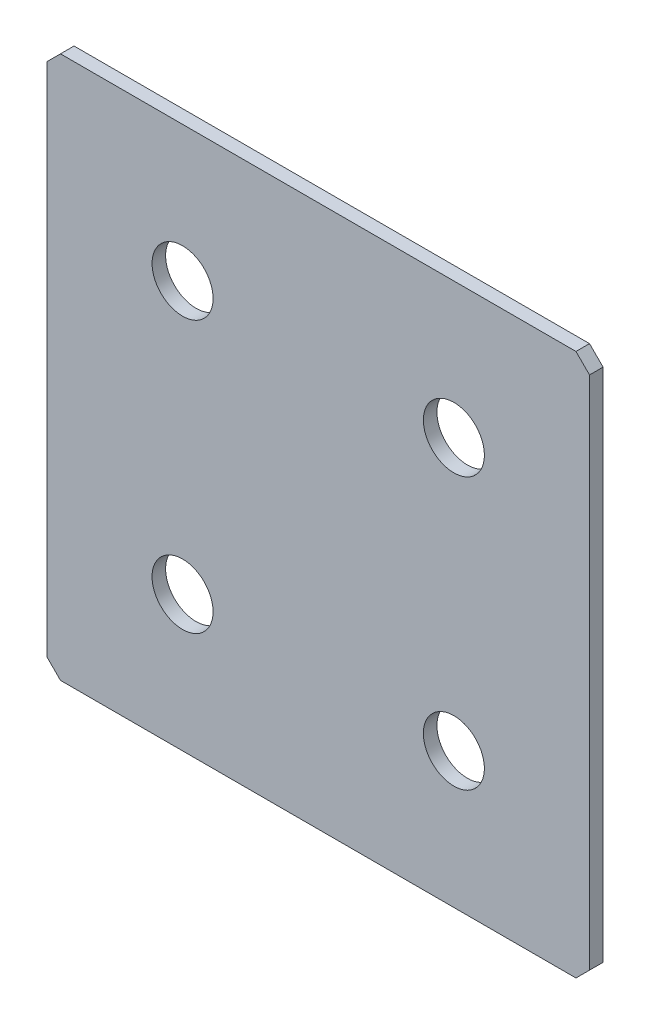
ISO-10303-21;
HEADER;
FILE_DESCRIPTION(('STEP AP214'),'2;1');
FILE_NAME('part.step','',(''),(''),'','','');
FILE_SCHEMA(('AUTOMOTIVE_DESIGN { 1 0 10303 214 1 1 1 1 }'));
ENDSEC;
DATA;
#1=APPLICATION_CONTEXT('core data for automotive mechanical design processes');
#2=APPLICATION_PROTOCOL_DEFINITION('international standard','automotive_design',2000,#1);
#3=PRODUCT_CONTEXT('',#1,'mechanical');
#4=PRODUCT('Part','Part','',(#3));
#5=PRODUCT_RELATED_PRODUCT_CATEGORY('part','',(#4));
#6=PRODUCT_DEFINITION_FORMATION('','',#4);
#7=PRODUCT_DEFINITION_CONTEXT('part definition',#1,'design');
#8=PRODUCT_DEFINITION('design','',#6,#7);
#9=PRODUCT_DEFINITION_SHAPE('','',#8);
#10=(LENGTH_UNIT() NAMED_UNIT(*) SI_UNIT(.MILLI.,.METRE.));
#11=(NAMED_UNIT(*) PLANE_ANGLE_UNIT() SI_UNIT($,.RADIAN.));
#12=(NAMED_UNIT(*) SI_UNIT($,.STERADIAN.) SOLID_ANGLE_UNIT());
#13=UNCERTAINTY_MEASURE_WITH_UNIT(LENGTH_MEASURE(1.E-05),#10,'distance_accuracy_value','');
#14=(GEOMETRIC_REPRESENTATION_CONTEXT(3) GLOBAL_UNCERTAINTY_ASSIGNED_CONTEXT((#13)) GLOBAL_UNIT_ASSIGNED_CONTEXT((#10,
#11,#12)) REPRESENTATION_CONTEXT('',''));
#15=CARTESIAN_POINT('',(0.,0.,0.));
#16=DIRECTION('',(0.,0.,1.));
#17=DIRECTION('',(1.,0.,0.));
#18=AXIS2_PLACEMENT_3D('',#15,#16,#17);
#19=CARTESIAN_POINT('',(40.,-40.,2.));
#20=DIRECTION('',(-1.,0.,0.));
#21=DIRECTION('',(0.,0.,1.));
#22=AXIS2_PLACEMENT_3D('',#19,#20,#21);
#23=PLANE('',#22);
#24=DIRECTION('',(0.,1.,0.));
#25=VECTOR('',#24,1.);
#26=CARTESIAN_POINT('',(40.,-40.,2.));
#27=LINE('',#26,#25);
#28=CARTESIAN_POINT('',(40.,-38.,2.));
#29=VERTEX_POINT('',#28);
#30=CARTESIAN_POINT('',(40.,38.,2.));
#31=VERTEX_POINT('',#30);
#32=EDGE_CURVE('E128',#29,#31,#27,.T.);
#33=ORIENTED_EDGE('',*,*,#32,.F.);
#34=DIRECTION('',(0.,0.,-1.));
#35=VECTOR('',#34,1.);
#36=CARTESIAN_POINT('',(40.,-38.,2.));
#37=LINE('',#36,#35);
#38=CARTESIAN_POINT('',(40.,-38.,0.));
#39=VERTEX_POINT('',#38);
#40=EDGE_CURVE('E154',#29,#39,#37,.T.);
#41=ORIENTED_EDGE('',*,*,#40,.T.);
#42=DIRECTION('',(0.,1.,0.));
#43=VECTOR('',#42,1.);
#44=CARTESIAN_POINT('',(40.,-40.,0.));
#45=LINE('',#44,#43);
#46=CARTESIAN_POINT('',(40.,38.,0.));
#47=VERTEX_POINT('',#46);
#48=EDGE_CURVE('E162',#39,#47,#45,.T.);
#49=ORIENTED_EDGE('',*,*,#48,.T.);
#50=DIRECTION('',(0.,0.,1.));
#51=VECTOR('',#50,1.);
#52=CARTESIAN_POINT('',(40.,38.,2.));
#53=LINE('',#52,#51);
#54=EDGE_CURVE('E152',#47,#31,#53,.T.);
#55=ORIENTED_EDGE('',*,*,#54,.T.);
#56=EDGE_LOOP('',(#33,#41,#49,#55));
#57=FACE_BOUND('',#56,.T.);
#58=ADVANCED_FACE('F37',(#57),#23,.F.);
#59=CARTESIAN_POINT('',(-40.,40.,2.));
#60=DIRECTION('',(0.,-1.,0.));
#61=DIRECTION('',(0.,0.,-1.));
#62=AXIS2_PLACEMENT_3D('',#59,#60,#61);
#63=PLANE('',#62);
#64=DIRECTION('',(-1.,0.,0.));
#65=VECTOR('',#64,1.);
#66=CARTESIAN_POINT('',(-40.,40.,0.));
#67=LINE('',#66,#65);
#68=CARTESIAN_POINT('',(38.,40.,0.));
#69=VERTEX_POINT('',#68);
#70=CARTESIAN_POINT('',(-38.,40.,0.));
#71=VERTEX_POINT('',#70);
#72=EDGE_CURVE('E133',#69,#71,#67,.T.);
#73=ORIENTED_EDGE('',*,*,#72,.T.);
#74=DIRECTION('',(0.,0.,1.));
#75=VECTOR('',#74,1.);
#76=CARTESIAN_POINT('',(-38.,40.,2.));
#77=LINE('',#76,#75);
#78=CARTESIAN_POINT('',(-38.,40.,2.));
#79=VERTEX_POINT('',#78);
#80=EDGE_CURVE('E11',#71,#79,#77,.T.);
#81=ORIENTED_EDGE('',*,*,#80,.T.);
#82=DIRECTION('',(-1.,0.,0.));
#83=VECTOR('',#82,1.);
#84=CARTESIAN_POINT('',(-40.,40.,2.));
#85=LINE('',#84,#83);
#86=CARTESIAN_POINT('',(38.,40.,2.));
#87=VERTEX_POINT('',#86);
#88=EDGE_CURVE('E131',#87,#79,#85,.T.);
#89=ORIENTED_EDGE('',*,*,#88,.F.);
#90=DIRECTION('',(0.,0.,-1.));
#91=VECTOR('',#90,1.);
#92=CARTESIAN_POINT('',(38.,40.,2.));
#93=LINE('',#92,#91);
#94=EDGE_CURVE('E45',#87,#69,#93,.T.);
#95=ORIENTED_EDGE('',*,*,#94,.T.);
#96=EDGE_LOOP('',(#73,#81,#89,#95));
#97=FACE_BOUND('',#96,.T.);
#98=ADVANCED_FACE('F159',(#97),#63,.F.);
#99=CARTESIAN_POINT('',(-40.,-40.,2.));
#100=DIRECTION('',(1.,0.,0.));
#101=DIRECTION('',(0.,0.,-1.));
#102=AXIS2_PLACEMENT_3D('',#99,#100,#101);
#103=PLANE('',#102);
#104=DIRECTION('',(0.,-1.,0.));
#105=VECTOR('',#104,1.);
#106=CARTESIAN_POINT('',(-40.,-40.,0.));
#107=LINE('',#106,#105);
#108=CARTESIAN_POINT('',(-40.,38.,0.));
#109=VERTEX_POINT('',#108);
#110=CARTESIAN_POINT('',(-40.,-38.,0.));
#111=VERTEX_POINT('',#110);
#112=EDGE_CURVE('E129',#109,#111,#107,.T.);
#113=ORIENTED_EDGE('',*,*,#112,.T.);
#114=DIRECTION('',(0.,0.,1.));
#115=VECTOR('',#114,1.);
#116=CARTESIAN_POINT('',(-40.,-38.,2.));
#117=LINE('',#116,#115);
#118=CARTESIAN_POINT('',(-40.,-38.,2.));
#119=VERTEX_POINT('',#118);
#120=EDGE_CURVE('E107',#111,#119,#117,.T.);
#121=ORIENTED_EDGE('',*,*,#120,.T.);
#122=DIRECTION('',(0.,-1.,0.));
#123=VECTOR('',#122,1.);
#124=CARTESIAN_POINT('',(-40.,-40.,2.));
#125=LINE('',#124,#123);
#126=CARTESIAN_POINT('',(-40.,38.,2.));
#127=VERTEX_POINT('',#126);
#128=EDGE_CURVE('E167',#127,#119,#125,.T.);
#129=ORIENTED_EDGE('',*,*,#128,.F.);
#130=DIRECTION('',(0.,0.,-1.));
#131=VECTOR('',#130,1.);
#132=CARTESIAN_POINT('',(-40.,38.,2.));
#133=LINE('',#132,#131);
#134=EDGE_CURVE('E112',#127,#109,#133,.T.);
#135=ORIENTED_EDGE('',*,*,#134,.T.);
#136=EDGE_LOOP('',(#113,#121,#129,#135));
#137=FACE_BOUND('',#136,.T.);
#138=ADVANCED_FACE('F210',(#137),#103,.F.);
#139=CARTESIAN_POINT('',(-40.,-40.,2.));
#140=DIRECTION('',(0.,1.,0.));
#141=DIRECTION('',(0.,0.,1.));
#142=AXIS2_PLACEMENT_3D('',#139,#140,#141);
#143=PLANE('',#142);
#144=DIRECTION('',(1.,0.,0.));
#145=VECTOR('',#144,1.);
#146=CARTESIAN_POINT('',(-40.,-40.,2.));
#147=LINE('',#146,#145);
#148=CARTESIAN_POINT('',(-38.,-40.,2.));
#149=VERTEX_POINT('',#148);
#150=CARTESIAN_POINT('',(38.,-40.,2.));
#151=VERTEX_POINT('',#150);
#152=EDGE_CURVE('E122',#149,#151,#147,.T.);
#153=ORIENTED_EDGE('',*,*,#152,.F.);
#154=DIRECTION('',(0.,0.,-1.));
#155=VECTOR('',#154,1.);
#156=CARTESIAN_POINT('',(-38.,-40.,2.));
#157=LINE('',#156,#155);
#158=CARTESIAN_POINT('',(-38.,-40.,0.));
#159=VERTEX_POINT('',#158);
#160=EDGE_CURVE('E106',#149,#159,#157,.T.);
#161=ORIENTED_EDGE('',*,*,#160,.T.);
#162=DIRECTION('',(1.,0.,0.));
#163=VECTOR('',#162,1.);
#164=CARTESIAN_POINT('',(-40.,-40.,0.));
#165=LINE('',#164,#163);
#166=CARTESIAN_POINT('',(38.,-40.,0.));
#167=VERTEX_POINT('',#166);
#168=EDGE_CURVE('E119',#159,#167,#165,.T.);
#169=ORIENTED_EDGE('',*,*,#168,.T.);
#170=DIRECTION('',(0.,0.,1.));
#171=VECTOR('',#170,1.);
#172=CARTESIAN_POINT('',(38.,-40.,2.));
#173=LINE('',#172,#171);
#174=EDGE_CURVE('E124',#167,#151,#173,.T.);
#175=ORIENTED_EDGE('',*,*,#174,.T.);
#176=EDGE_LOOP('',(#153,#161,#169,#175));
#177=FACE_BOUND('',#176,.T.);
#178=ADVANCED_FACE('F118',(#177),#143,.F.);
#179=CARTESIAN_POINT('',(0.,0.,2.));
#180=DIRECTION('',(0.,0.,-1.));
#181=DIRECTION('',(-1.,0.,0.));
#182=AXIS2_PLACEMENT_3D('',#179,#180,#181);
#183=PLANE('',#182);
#184=CARTESIAN_POINT('',(-20.,20.,2.));
#185=DIRECTION('',(0.,0.,1.));
#186=DIRECTION('',(1.,0.,0.));
#187=AXIS2_PLACEMENT_3D('',#184,#185,#186);
#188=CIRCLE('',#187,4.5);
#189=CARTESIAN_POINT('',(-15.5,20.,2.));
#190=VERTEX_POINT('',#189);
#191=EDGE_CURVE('E191',#190,#190,#188,.T.);
#192=ORIENTED_EDGE('',*,*,#191,.F.);
#193=EDGE_LOOP('',(#192));
#194=FACE_BOUND('',#193,.T.);
#195=CARTESIAN_POINT('',(20.,20.,2.));
#196=DIRECTION('',(0.,0.,1.));
#197=DIRECTION('',(1.,0.,0.));
#198=AXIS2_PLACEMENT_3D('',#195,#196,#197);
#199=CIRCLE('',#198,4.5);
#200=CARTESIAN_POINT('',(24.5,20.,2.));
#201=VERTEX_POINT('',#200);
#202=EDGE_CURVE('E185',#201,#201,#199,.T.);
#203=ORIENTED_EDGE('',*,*,#202,.F.);
#204=EDGE_LOOP('',(#203));
#205=FACE_BOUND('',#204,.T.);
#206=CARTESIAN_POINT('',(-20.,-20.,2.));
#207=DIRECTION('',(0.,0.,1.));
#208=DIRECTION('',(1.,0.,0.));
#209=AXIS2_PLACEMENT_3D('',#206,#207,#208);
#210=CIRCLE('',#209,4.5);
#211=CARTESIAN_POINT('',(-15.5,-20.,2.));
#212=VERTEX_POINT('',#211);
#213=EDGE_CURVE('E179',#212,#212,#210,.T.);
#214=ORIENTED_EDGE('',*,*,#213,.F.);
#215=EDGE_LOOP('',(#214));
#216=FACE_BOUND('',#215,.T.);
#217=CARTESIAN_POINT('',(20.,-20.,2.));
#218=DIRECTION('',(0.,0.,1.));
#219=DIRECTION('',(1.,0.,0.));
#220=AXIS2_PLACEMENT_3D('',#217,#218,#219);
#221=CIRCLE('',#220,4.5);
#222=CARTESIAN_POINT('',(24.5,-20.,2.));
#223=VERTEX_POINT('',#222);
#224=EDGE_CURVE('E173',#223,#223,#221,.T.);
#225=ORIENTED_EDGE('',*,*,#224,.F.);
#226=EDGE_LOOP('',(#225));
#227=FACE_BOUND('',#226,.T.);
#228=ORIENTED_EDGE('',*,*,#128,.T.);
#229=DIRECTION('',(-0.707106781186548,0.707106781186548,0.));
#230=VECTOR('',#229,1.);
#231=CARTESIAN_POINT('',(-38.,-40.,2.));
#232=LINE('',#231,#230);
#233=EDGE_CURVE('E150',#119,#149,#232,.F.);
#234=ORIENTED_EDGE('',*,*,#233,.T.);
#235=ORIENTED_EDGE('',*,*,#152,.T.);
#236=DIRECTION('',(-0.707106781186548,-0.707106781186548,0.));
#237=VECTOR('',#236,1.);
#238=CARTESIAN_POINT('',(40.,-38.,2.));
#239=LINE('',#238,#237);
#240=EDGE_CURVE('E148',#151,#29,#239,.F.);
#241=ORIENTED_EDGE('',*,*,#240,.T.);
#242=ORIENTED_EDGE('',*,*,#32,.T.);
#243=DIRECTION('',(0.707106781186548,-0.707106781186548,0.));
#244=VECTOR('',#243,1.);
#245=CARTESIAN_POINT('',(38.,40.,2.));
#246=LINE('',#245,#244);
#247=EDGE_CURVE('E57',#31,#87,#246,.F.);
#248=ORIENTED_EDGE('',*,*,#247,.T.);
#249=ORIENTED_EDGE('',*,*,#88,.T.);
#250=DIRECTION('',(0.707106781186548,0.707106781186548,0.));
#251=VECTOR('',#250,1.);
#252=CARTESIAN_POINT('',(-40.,38.,2.));
#253=LINE('',#252,#251);
#254=EDGE_CURVE('E146',#79,#127,#253,.F.);
#255=ORIENTED_EDGE('',*,*,#254,.T.);
#256=EDGE_LOOP('',(#228,#234,#235,#241,#242,#248,#249,#255));
#257=FACE_BOUND('',#256,.T.);
#258=ADVANCED_FACE('F197',(#194,#205,#216,#227,#257),#183,.F.);
#259=CARTESIAN_POINT('',(0.,0.,0.));
#260=DIRECTION('',(0.,0.,-1.));
#261=DIRECTION('',(-1.,0.,0.));
#262=AXIS2_PLACEMENT_3D('',#259,#260,#261);
#263=PLANE('',#262);
#264=CARTESIAN_POINT('',(-20.,20.,0.));
#265=DIRECTION('',(0.,0.,1.));
#266=DIRECTION('',(1.,0.,0.));
#267=AXIS2_PLACEMENT_3D('',#264,#265,#266);
#268=CIRCLE('',#267,4.5);
#269=CARTESIAN_POINT('',(-15.5,20.,0.));
#270=VERTEX_POINT('',#269);
#271=EDGE_CURVE('E188',#270,#270,#268,.T.);
#272=ORIENTED_EDGE('',*,*,#271,.T.);
#273=EDGE_LOOP('',(#272));
#274=FACE_BOUND('',#273,.T.);
#275=CARTESIAN_POINT('',(20.,20.,0.));
#276=DIRECTION('',(0.,0.,1.));
#277=DIRECTION('',(1.,0.,0.));
#278=AXIS2_PLACEMENT_3D('',#275,#276,#277);
#279=CIRCLE('',#278,4.5);
#280=CARTESIAN_POINT('',(24.5,20.,0.));
#281=VERTEX_POINT('',#280);
#282=EDGE_CURVE('E182',#281,#281,#279,.T.);
#283=ORIENTED_EDGE('',*,*,#282,.T.);
#284=EDGE_LOOP('',(#283));
#285=FACE_BOUND('',#284,.T.);
#286=CARTESIAN_POINT('',(-20.,-20.,0.));
#287=DIRECTION('',(0.,0.,1.));
#288=DIRECTION('',(1.,0.,0.));
#289=AXIS2_PLACEMENT_3D('',#286,#287,#288);
#290=CIRCLE('',#289,4.5);
#291=CARTESIAN_POINT('',(-15.5,-20.,0.));
#292=VERTEX_POINT('',#291);
#293=EDGE_CURVE('E176',#292,#292,#290,.T.);
#294=ORIENTED_EDGE('',*,*,#293,.T.);
#295=EDGE_LOOP('',(#294));
#296=FACE_BOUND('',#295,.T.);
#297=CARTESIAN_POINT('',(20.,-20.,0.));
#298=DIRECTION('',(0.,0.,1.));
#299=DIRECTION('',(1.,0.,0.));
#300=AXIS2_PLACEMENT_3D('',#297,#298,#299);
#301=CIRCLE('',#300,4.5);
#302=CARTESIAN_POINT('',(24.5,-20.,0.));
#303=VERTEX_POINT('',#302);
#304=EDGE_CURVE('E163',#303,#303,#301,.T.);
#305=ORIENTED_EDGE('',*,*,#304,.T.);
#306=EDGE_LOOP('',(#305));
#307=FACE_BOUND('',#306,.T.);
#308=ORIENTED_EDGE('',*,*,#168,.F.);
#309=DIRECTION('',(0.707106781186548,-0.707106781186548,0.));
#310=VECTOR('',#309,1.);
#311=CARTESIAN_POINT('',(-39.,-39.,0.));
#312=LINE('',#311,#310);
#313=EDGE_CURVE('E102',#159,#111,#312,.F.);
#314=ORIENTED_EDGE('',*,*,#313,.T.);
#315=ORIENTED_EDGE('',*,*,#112,.F.);
#316=DIRECTION('',(-0.707106781186548,-0.707106781186548,0.));
#317=VECTOR('',#316,1.);
#318=CARTESIAN_POINT('',(-39.,39.,0.));
#319=LINE('',#318,#317);
#320=EDGE_CURVE('E139',#109,#71,#319,.F.);
#321=ORIENTED_EDGE('',*,*,#320,.T.);
#322=ORIENTED_EDGE('',*,*,#72,.F.);
#323=DIRECTION('',(-0.707106781186548,0.707106781186548,0.));
#324=VECTOR('',#323,1.);
#325=CARTESIAN_POINT('',(39.,39.,0.));
#326=LINE('',#325,#324);
#327=EDGE_CURVE('E123',#69,#47,#326,.F.);
#328=ORIENTED_EDGE('',*,*,#327,.T.);
#329=ORIENTED_EDGE('',*,*,#48,.F.);
#330=DIRECTION('',(0.707106781186548,0.707106781186548,0.));
#331=VECTOR('',#330,1.);
#332=CARTESIAN_POINT('',(39.,-39.,0.));
#333=LINE('',#332,#331);
#334=EDGE_CURVE('E113',#39,#167,#333,.F.);
#335=ORIENTED_EDGE('',*,*,#334,.T.);
#336=EDGE_LOOP('',(#308,#314,#315,#321,#322,#328,#329,#335));
#337=FACE_BOUND('',#336,.T.);
#338=ADVANCED_FACE('F126',(#274,#285,#296,#307,#337),#263,.T.);
#339=CARTESIAN_POINT('',(-38.,-40.,2.));
#340=DIRECTION('',(0.707106781186547,0.707106781186547,0.));
#341=DIRECTION('',(0.,0.,-1.));
#342=AXIS2_PLACEMENT_3D('',#339,#340,#341);
#343=PLANE('',#342);
#344=ORIENTED_EDGE('',*,*,#233,.F.);
#345=ORIENTED_EDGE('',*,*,#120,.F.);
#346=ORIENTED_EDGE('',*,*,#313,.F.);
#347=ORIENTED_EDGE('',*,*,#160,.F.);
#348=EDGE_LOOP('',(#344,#345,#346,#347));
#349=FACE_BOUND('',#348,.T.);
#350=ADVANCED_FACE('F105',(#349),#343,.F.);
#351=CARTESIAN_POINT('',(40.,-38.,2.));
#352=DIRECTION('',(-0.707106781186547,0.707106781186547,0.));
#353=DIRECTION('',(0.,0.,-1.));
#354=AXIS2_PLACEMENT_3D('',#351,#352,#353);
#355=PLANE('',#354);
#356=ORIENTED_EDGE('',*,*,#240,.F.);
#357=ORIENTED_EDGE('',*,*,#174,.F.);
#358=ORIENTED_EDGE('',*,*,#334,.F.);
#359=ORIENTED_EDGE('',*,*,#40,.F.);
#360=EDGE_LOOP('',(#356,#357,#358,#359));
#361=FACE_BOUND('',#360,.T.);
#362=ADVANCED_FACE('F214',(#361),#355,.F.);
#363=CARTESIAN_POINT('',(-40.,38.,2.));
#364=DIRECTION('',(0.707106781186547,-0.707106781186547,0.));
#365=DIRECTION('',(0.,0.,-1.));
#366=AXIS2_PLACEMENT_3D('',#363,#364,#365);
#367=PLANE('',#366);
#368=ORIENTED_EDGE('',*,*,#254,.F.);
#369=ORIENTED_EDGE('',*,*,#80,.F.);
#370=ORIENTED_EDGE('',*,*,#320,.F.);
#371=ORIENTED_EDGE('',*,*,#134,.F.);
#372=EDGE_LOOP('',(#368,#369,#370,#371));
#373=FACE_BOUND('',#372,.T.);
#374=ADVANCED_FACE('F212',(#373),#367,.F.);
#375=CARTESIAN_POINT('',(38.,40.,2.));
#376=DIRECTION('',(-0.707106781186547,-0.707106781186547,0.));
#377=DIRECTION('',(0.,0.,-1.));
#378=AXIS2_PLACEMENT_3D('',#375,#376,#377);
#379=PLANE('',#378);
#380=ORIENTED_EDGE('',*,*,#247,.F.);
#381=ORIENTED_EDGE('',*,*,#54,.F.);
#382=ORIENTED_EDGE('',*,*,#327,.F.);
#383=ORIENTED_EDGE('',*,*,#94,.F.);
#384=EDGE_LOOP('',(#380,#381,#382,#383));
#385=FACE_BOUND('',#384,.T.);
#386=ADVANCED_FACE('F39',(#385),#379,.F.);
#387=CARTESIAN_POINT('',(20.,-20.,2.));
#388=DIRECTION('',(0.,0.,1.));
#389=DIRECTION('',(1.,0.,0.));
#390=AXIS2_PLACEMENT_3D('',#387,#388,#389);
#391=CYLINDRICAL_SURFACE('',#390,4.5);
#392=ORIENTED_EDGE('',*,*,#304,.F.);
#393=EDGE_LOOP('',(#392));
#394=FACE_BOUND('',#393,.T.);
#395=ORIENTED_EDGE('',*,*,#224,.T.);
#396=EDGE_LOOP('',(#395));
#397=FACE_BOUND('',#396,.T.);
#398=ADVANCED_FACE('F219',(#394,#397),#391,.F.);
#399=CARTESIAN_POINT('',(-20.,-20.,2.));
#400=DIRECTION('',(0.,0.,1.));
#401=DIRECTION('',(1.,0.,0.));
#402=AXIS2_PLACEMENT_3D('',#399,#400,#401);
#403=CYLINDRICAL_SURFACE('',#402,4.5);
#404=ORIENTED_EDGE('',*,*,#293,.F.);
#405=EDGE_LOOP('',(#404));
#406=FACE_BOUND('',#405,.T.);
#407=ORIENTED_EDGE('',*,*,#213,.T.);
#408=EDGE_LOOP('',(#407));
#409=FACE_BOUND('',#408,.T.);
#410=ADVANCED_FACE('F274',(#406,#409),#403,.F.);
#411=CARTESIAN_POINT('',(20.,20.,2.));
#412=DIRECTION('',(0.,0.,1.));
#413=DIRECTION('',(1.,0.,0.));
#414=AXIS2_PLACEMENT_3D('',#411,#412,#413);
#415=CYLINDRICAL_SURFACE('',#414,4.5);
#416=ORIENTED_EDGE('',*,*,#282,.F.);
#417=EDGE_LOOP('',(#416));
#418=FACE_BOUND('',#417,.T.);
#419=ORIENTED_EDGE('',*,*,#202,.T.);
#420=EDGE_LOOP('',(#419));
#421=FACE_BOUND('',#420,.T.);
#422=ADVANCED_FACE('F283',(#418,#421),#415,.F.);
#423=CARTESIAN_POINT('',(-20.,20.,2.));
#424=DIRECTION('',(0.,0.,1.));
#425=DIRECTION('',(1.,0.,0.));
#426=AXIS2_PLACEMENT_3D('',#423,#424,#425);
#427=CYLINDRICAL_SURFACE('',#426,4.5);
#428=ORIENTED_EDGE('',*,*,#271,.F.);
#429=EDGE_LOOP('',(#428));
#430=FACE_BOUND('',#429,.T.);
#431=ORIENTED_EDGE('',*,*,#191,.T.);
#432=EDGE_LOOP('',(#431));
#433=FACE_BOUND('',#432,.T.);
#434=ADVANCED_FACE('F195',(#430,#433),#427,.F.);
#435=CLOSED_SHELL('',(#58,#98,#138,#178,#258,#338,#350,#362,#374,#386,#398,#410,#422,#434));
#436=MANIFOLD_SOLID_BREP('B2',#435);
#437=ADVANCED_BREP_SHAPE_REPRESENTATION('',(#18,#436),#14);
#438=SHAPE_DEFINITION_REPRESENTATION(#9,#437);
ENDSEC;
END-ISO-10303-21;
